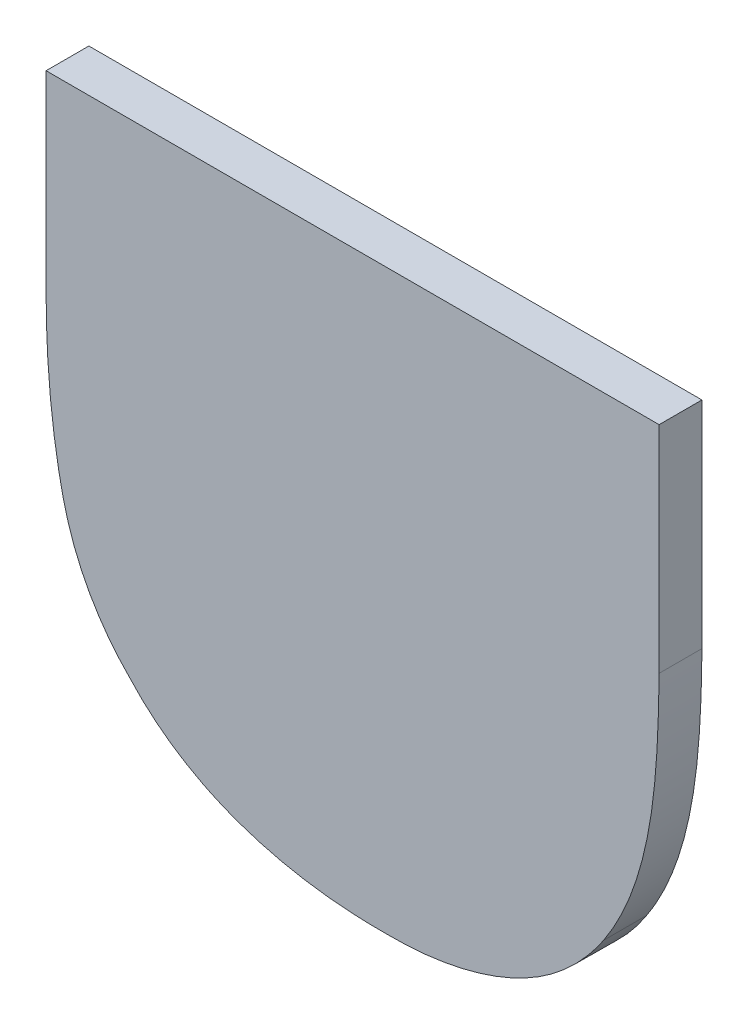
ISO-10303-21;
HEADER;
FILE_DESCRIPTION(('STEP AP214'),'2;1');
FILE_NAME('part.step','',(''),(''),'','','');
FILE_SCHEMA(('AUTOMOTIVE_DESIGN { 1 0 10303 214 1 1 1 1 }'));
ENDSEC;
DATA;
#1=APPLICATION_CONTEXT('core data for automotive mechanical design processes');
#2=APPLICATION_PROTOCOL_DEFINITION('international standard','automotive_design',2000,#1);
#3=PRODUCT_CONTEXT('',#1,'mechanical');
#4=PRODUCT('Part','Part','',(#3));
#5=PRODUCT_RELATED_PRODUCT_CATEGORY('part','',(#4));
#6=PRODUCT_DEFINITION_FORMATION('','',#4);
#7=PRODUCT_DEFINITION_CONTEXT('part definition',#1,'design');
#8=PRODUCT_DEFINITION('design','',#6,#7);
#9=PRODUCT_DEFINITION_SHAPE('','',#8);
#10=(LENGTH_UNIT() NAMED_UNIT(*) SI_UNIT(.MILLI.,.METRE.));
#11=(NAMED_UNIT(*) PLANE_ANGLE_UNIT() SI_UNIT($,.RADIAN.));
#12=(NAMED_UNIT(*) SI_UNIT($,.STERADIAN.) SOLID_ANGLE_UNIT());
#13=UNCERTAINTY_MEASURE_WITH_UNIT(LENGTH_MEASURE(1.E-05),#10,'distance_accuracy_value','');
#14=(GEOMETRIC_REPRESENTATION_CONTEXT(3) GLOBAL_UNCERTAINTY_ASSIGNED_CONTEXT((#13)) GLOBAL_UNIT_ASSIGNED_CONTEXT((#10,
#11,#12)) REPRESENTATION_CONTEXT('',''));
#15=CARTESIAN_POINT('',(0.,0.,0.));
#16=DIRECTION('',(0.,0.,1.));
#17=DIRECTION('',(1.,0.,0.));
#18=AXIS2_PLACEMENT_3D('',#15,#16,#17);
#19=CARTESIAN_POINT('',(0.347917285868027,-0.886536157779015,0.));
#20=DIRECTION('',(1.,0.,0.));
#21=DIRECTION('',(0.,1.,0.));
#22=AXIS2_PLACEMENT_3D('',#19,#20,#21);
#23=PLANE('',#22);
#24=DIRECTION('',(0.,-1.,0.));
#25=VECTOR('',#24,1.);
#26=CARTESIAN_POINT('',(0.347917285868027,-0.876470841363199,-0.001));
#27=LINE('',#26,#25);
#28=CARTESIAN_POINT('',(0.347917285868027,-0.876470841363199,-0.001));
#29=VERTEX_POINT('',#28);
#30=CARTESIAN_POINT('',(0.347917285868027,-0.886536157779015,-0.001));
#31=VERTEX_POINT('',#30);
#32=EDGE_CURVE('E11',#29,#31,#27,.T.);
#33=ORIENTED_EDGE('',*,*,#32,.F.);
#34=DIRECTION('',(0.,0.,1.));
#35=VECTOR('',#34,1.);
#36=CARTESIAN_POINT('',(0.347917285868027,-0.876470841363199,-0.001));
#37=LINE('',#36,#35);
#38=CARTESIAN_POINT('',(0.347917285868027,-0.876470841363199,0.001));
#39=VERTEX_POINT('',#38);
#40=EDGE_CURVE('E154',#29,#39,#37,.T.);
#41=ORIENTED_EDGE('',*,*,#40,.T.);
#42=DIRECTION('',(0.,1.,0.));
#43=VECTOR('',#42,1.);
#44=CARTESIAN_POINT('',(0.347917285868027,-0.886536157779015,0.001));
#45=LINE('',#44,#43);
#46=CARTESIAN_POINT('',(0.347917285868027,-0.886536157779015,0.001));
#47=VERTEX_POINT('',#46);
#48=EDGE_CURVE('E98',#47,#39,#45,.T.);
#49=ORIENTED_EDGE('',*,*,#48,.F.);
#50=DIRECTION('',(0.,0.,1.));
#51=VECTOR('',#50,1.);
#52=CARTESIAN_POINT('',(0.347917285868027,-0.886536157779015,-0.001));
#53=LINE('',#52,#51);
#54=EDGE_CURVE('E155',#31,#47,#53,.T.);
#55=ORIENTED_EDGE('',*,*,#54,.F.);
#56=EDGE_LOOP('',(#33,#41,#49,#55));
#57=FACE_BOUND('',#56,.T.);
#58=ADVANCED_FACE('F17',(#57),#23,.T.);
#59=CARTESIAN_POINT('',(0.345323768754749,-0.898639237640978,-0.0015));
#60=CARTESIAN_POINT('',(0.345323768754749,-0.898639237640978,0.0015));
#61=CARTESIAN_POINT('',(0.346744028126305,-0.896477973379914,-0.0015));
#62=CARTESIAN_POINT('',(0.346744028126305,-0.896477973379914,0.0015));
#63=CARTESIAN_POINT('',(0.347917285868027,-0.890735185486226,-0.0015));
#64=CARTESIAN_POINT('',(0.347917285868027,-0.890735185486226,0.0015));
#65=CARTESIAN_POINT('',(0.347917285868027,-0.886536157779015,-0.0015));
#66=CARTESIAN_POINT('',(0.347917285868027,-0.886536157779015,0.0015));
#67=B_SPLINE_SURFACE_WITH_KNOTS('',2,1,((#59,#60),(#61,#62),(#63,#64),(#65,#66)),.UNSPECIFIED.,
.F.,.F.,.F.,(3,1,3),(2,2),(0.,0.5,1.),(0.,1.),.UNSPECIFIED.);
#68=CARTESIAN_POINT('',(0.347917285868027,-0.886536157779015,-0.001));
#69=CARTESIAN_POINT('',(0.347897046364982,-0.888475739742811,-0.001));
#70=CARTESIAN_POINT('',(0.347837067685021,-0.890524183312478,-0.001));
#71=CARTESIAN_POINT('',(0.34729821677121,-0.893963282759517,-0.001));
#72=CARTESIAN_POINT('',(0.346939214250349,-0.895379773236329,-0.001));
#73=CARTESIAN_POINT('',(0.346077134854573,-0.897375988092695,-0.001));
#74=CARTESIAN_POINT('',(0.34573299174689,-0.898023229237234,-0.001));
#75=CARTESIAN_POINT('',(0.345323769955808,-0.898639235813278,-0.001));
#76=B_SPLINE_CURVE_WITH_KNOTS('',3,(#68,#69,#70,#71,#72,#73,#74,#75),.UNSPECIFIED.,.F.,.F.,(4,2,
2,4),(0.,0.00599493220095094,0.0103394260310423,0.0125364205913056),.UNSPECIFIED.);
#77=CARTESIAN_POINT('',(0.345323768754749,-0.898639237640978,-0.001));
#78=VERTEX_POINT('',#77);
#79=EDGE_CURVE('E24',#31,#78,#76,.T.);
#80=CARTESIAN_POINT('',(0.345323768754749,-0.898639237640978,0.001));
#81=CARTESIAN_POINT('',(0.346080441199102,-0.897495281511019,0.001));
#82=CARTESIAN_POINT('',(0.346612732508816,-0.896265386786534,0.001));
#83=CARTESIAN_POINT('',(0.347422866538483,-0.893508900287757,0.001));
#84=CARTESIAN_POINT('',(0.347648296370756,-0.891965906220623,0.001));
#85=CARTESIAN_POINT('',(0.347871267663927,-0.889116463505151,0.001));
#86=CARTESIAN_POINT('',(0.347899995515492,-0.887812505666125,0.001));
#87=CARTESIAN_POINT('',(0.347917285868027,-0.886536157779015,0.001));
#88=B_SPLINE_CURVE_WITH_KNOTS('',3,(#80,#81,#82,#83,#84,#85,#86,#87),.UNSPECIFIED.,.F.,.F.,(4,2,
2,4),(0.,0.00401420591504729,0.00865238375037323,0.0125336361899949),.UNSPECIFIED.);
#89=CARTESIAN_POINT('',(0.345323768754749,-0.898639237640978,0.001));
#90=VERTEX_POINT('',#89);
#91=EDGE_CURVE('E206',#90,#47,#88,.T.);
#92=DIRECTION('',(0.,0.,1.));
#93=VECTOR('',#92,1.);
#94=CARTESIAN_POINT('',(0.345323768754749,-0.898639237640978,-0.001));
#95=LINE('',#94,#93);
#96=EDGE_CURVE('E109',#78,#90,#95,.T.);
#97=ORIENTED_EDGE('',*,*,#79,.F.);
#98=ORIENTED_EDGE('',*,*,#54,.T.);
#99=ORIENTED_EDGE('',*,*,#91,.F.);
#100=ORIENTED_EDGE('',*,*,#96,.F.);
#101=EDGE_LOOP('',(#97,#98,#99,#100));
#102=FACE_BOUND('',#101,.T.);
#103=ADVANCED_FACE('F139',(#102),#67,.T.);
#104=CARTESIAN_POINT('',(0.335196701931473,-0.90345576942278,-0.0015));
#105=CARTESIAN_POINT('',(0.335196701931473,-0.90345576942278,0.0015));
#106=CARTESIAN_POINT('',(0.33853122393426,-0.90345576942278,-0.0015));
#107=CARTESIAN_POINT('',(0.33853122393426,-0.90345576942278,0.0015));
#108=CARTESIAN_POINT('',(0.343656507753354,-0.901109253939338,-0.0015));
#109=CARTESIAN_POINT('',(0.343656507753354,-0.901109253939338,0.0015));
#110=CARTESIAN_POINT('',(0.345323768754749,-0.898639237640978,-0.0015));
#111=CARTESIAN_POINT('',(0.345323768754749,-0.898639237640978,0.0015));
#112=B_SPLINE_SURFACE_WITH_KNOTS('',2,1,((#104,#105),(#106,#107),(#108,#109),(#110,#111)),
.UNSPECIFIED.,.F.,.F.,.F.,(3,1,3),(2,2),(0.,0.5,1.),(0.,1.),.UNSPECIFIED.);
#113=CARTESIAN_POINT('',(0.345323768754749,-0.898639237640978,-0.001));
#114=CARTESIAN_POINT('',(0.344734853257119,-0.899568366142899,-0.001));
#115=CARTESIAN_POINT('',(0.343982251990601,-0.900373776664964,-0.001));
#116=CARTESIAN_POINT('',(0.342298146571294,-0.901681608063643,-0.001));
#117=CARTESIAN_POINT('',(0.341375697767304,-0.90219554041433,-0.001));
#118=CARTESIAN_POINT('',(0.339291439211212,-0.903002517016533,-0.001));
#119=CARTESIAN_POINT('',(0.338114275327939,-0.903253297250384,-0.001));
#120=CARTESIAN_POINT('',(0.336350580432896,-0.90342912278177,-0.001));
#121=CARTESIAN_POINT('',(0.335771640335706,-0.90345535977683,-0.001));
#122=CARTESIAN_POINT('',(0.335196699439591,-0.90345576942278,-0.001));
#123=B_SPLINE_CURVE_WITH_KNOTS('',3,(#113,#114,#115,#116,#117,#118,#119,#120,#121,#122),
.UNSPECIFIED.,.F.,.F.,(4,2,2,2,4),(0.,0.00325917926200646,0.00637860238294145,
0.00994552343462519,0.0116780444668039),.UNSPECIFIED.);
#124=CARTESIAN_POINT('',(0.335196701931473,-0.90345576942278,-0.001));
#125=VERTEX_POINT('',#124);
#126=EDGE_CURVE('E147',#78,#125,#123,.T.);
#127=CARTESIAN_POINT('',(0.335196701931473,-0.90345576942278,0.001));
#128=CARTESIAN_POINT('',(0.336716202489575,-0.903476443464815,0.001));
#129=CARTESIAN_POINT('',(0.338304646776791,-0.903269722110897,0.001));
#130=CARTESIAN_POINT('',(0.340893616482345,-0.902429352559061,0.001));
#131=CARTESIAN_POINT('',(0.341939610540156,-0.901920705360191,0.001));
#132=CARTESIAN_POINT('',(0.343341255163998,-0.900887766351497,0.001));
#133=CARTESIAN_POINT('',(0.343787173464901,-0.900488336916783,0.001));
#134=CARTESIAN_POINT('',(0.344610967095562,-0.899614244805784,0.001));
#135=CARTESIAN_POINT('',(0.344987885543507,-0.899138674075068,0.001));
#136=CARTESIAN_POINT('',(0.345323768875331,-0.898639237462339,0.001));
#137=B_SPLINE_CURVE_WITH_KNOTS('',3,(#127,#128,#129,#130,#131,#132,#133,#134,#135,#136),
.UNSPECIFIED.,.F.,.F.,(4,2,2,2,4),(0.,0.00464434018493601,0.00808092896431612,
0.00986685997050239,0.0116759399575382),.UNSPECIFIED.);
#138=CARTESIAN_POINT('',(0.335196701931473,-0.90345576942278,0.001));
#139=VERTEX_POINT('',#138);
#140=EDGE_CURVE('E193',#139,#90,#137,.T.);
#141=DIRECTION('',(0.,0.,-1.));
#142=VECTOR('',#141,1.);
#143=CARTESIAN_POINT('',(0.335196701931473,-0.90345576942278,0.001));
#144=LINE('',#143,#142);
#145=EDGE_CURVE('E200',#139,#125,#144,.T.);
#146=ORIENTED_EDGE('',*,*,#126,.F.);
#147=ORIENTED_EDGE('',*,*,#96,.T.);
#148=ORIENTED_EDGE('',*,*,#140,.F.);
#149=ORIENTED_EDGE('',*,*,#145,.T.);
#150=EDGE_LOOP('',(#146,#147,#148,#149));
#151=FACE_BOUND('',#150,.T.);
#152=ADVANCED_FACE('F135',(#151),#112,.T.);
#153=CARTESIAN_POINT('',(0.323217122884428,-0.899133240900648,-0.0015));
#154=CARTESIAN_POINT('',(0.323217122884428,-0.899133240900648,0.0015));
#155=CARTESIAN_POINT('',(0.325316636738034,-0.901356255569174,-0.0015));
#156=CARTESIAN_POINT('',(0.325316636738034,-0.901356255569174,0.0015));
#157=CARTESIAN_POINT('',(0.331244675854099,-0.90345576942278,-0.0015));
#158=CARTESIAN_POINT('',(0.331244675854099,-0.90345576942278,0.0015));
#159=CARTESIAN_POINT('',(0.335196701931473,-0.90345576942278,-0.0015));
#160=CARTESIAN_POINT('',(0.335196701931473,-0.90345576942278,0.0015));
#161=B_SPLINE_SURFACE_WITH_KNOTS('',2,1,((#153,#154),(#155,#156),(#157,#158),(#159,#160)),
.UNSPECIFIED.,.F.,.F.,.F.,(3,1,3),(2,2),(0.,0.5,1.),(0.,1.),.UNSPECIFIED.);
#162=CARTESIAN_POINT('',(0.335196701931473,-0.90345576942278,-0.001));
#163=CARTESIAN_POINT('',(0.334203486748448,-0.903450311446005,-0.001));
#164=CARTESIAN_POINT('',(0.333205007331225,-0.903403812510657,-0.001));
#165=CARTESIAN_POINT('',(0.331210286285869,-0.903175252313575,-0.001));
#166=CARTESIAN_POINT('',(0.330214286370927,-0.902991238037913,-0.001));
#167=CARTESIAN_POINT('',(0.327863731895975,-0.90231507219139,-0.001));
#168=CARTESIAN_POINT('',(0.326531904126368,-0.901726738528531,-0.001));
#169=CARTESIAN_POINT('',(0.324564610621589,-0.900421256179006,-0.001));
#170=CARTESIAN_POINT('',(0.323848710923575,-0.899821592367772,-0.001));
#171=CARTESIAN_POINT('',(0.323217122851809,-0.89913324086611,-0.001));
#172=B_SPLINE_CURVE_WITH_KNOTS('',3,(#162,#163,#164,#165,#166,#167,#168,#169,#170,#171),
.UNSPECIFIED.,.F.,.F.,(4,2,2,2,4),(0.,0.00298647135879083,0.00601618283746282,
0.0103031655704413,0.0130870993535112),.UNSPECIFIED.);
#173=CARTESIAN_POINT('',(0.323217122884428,-0.899133240900648,-0.001));
#174=VERTEX_POINT('',#173);
#175=EDGE_CURVE('E105',#125,#174,#172,.T.);
#176=CARTESIAN_POINT('',(0.323217122884428,-0.899133240900648,0.001));
#177=CARTESIAN_POINT('',(0.32410977556624,-0.900114073477916,0.001));
#178=CARTESIAN_POINT('',(0.325151375142373,-0.900897835863709,0.001));
#179=CARTESIAN_POINT('',(0.327478967343012,-0.902160415157451,0.001));
#180=CARTESIAN_POINT('',(0.328774540324852,-0.902622121637017,0.001));
#181=CARTESIAN_POINT('',(0.331784641557628,-0.903322347279115,0.001));
#182=CARTESIAN_POINT('',(0.333522013588785,-0.903474416834438,0.001));
#183=CARTESIAN_POINT('',(0.335196704801078,-0.90345576942278,0.001));
#184=B_SPLINE_CURVE_WITH_KNOTS('',3,(#176,#177,#178,#179,#180,#181,#182,#183),.UNSPECIFIED.,.F.,
.F.,(4,2,2,4),(0.,0.00388468338967754,0.00796262500969223,0.0130761194440126),.UNSPECIFIED.);
#185=CARTESIAN_POINT('',(0.323217122884428,-0.899133240900648,0.001));
#186=VERTEX_POINT('',#185);
#187=EDGE_CURVE('E161',#186,#139,#184,.T.);
#188=DIRECTION('',(0.,0.,1.));
#189=VECTOR('',#188,1.);
#190=CARTESIAN_POINT('',(0.323217122884428,-0.899133240900648,-0.001));
#191=LINE('',#190,#189);
#192=EDGE_CURVE('E163',#174,#186,#191,.T.);
#193=ORIENTED_EDGE('',*,*,#175,.F.);
#194=ORIENTED_EDGE('',*,*,#145,.F.);
#195=ORIENTED_EDGE('',*,*,#187,.F.);
#196=ORIENTED_EDGE('',*,*,#192,.F.);
#197=EDGE_LOOP('',(#193,#194,#195,#196));
#198=FACE_BOUND('',#197,.T.);
#199=ADVANCED_FACE('F124',(#198),#161,.T.);
#200=CARTESIAN_POINT('',(0.319265096807054,-0.885362900037293,-0.0015));
#201=CARTESIAN_POINT('',(0.319265096807054,-0.885362900037293,0.0015));
#202=CARTESIAN_POINT('',(0.319265096807054,-0.889747178966884,-0.0015));
#203=CARTESIAN_POINT('',(0.319265096807054,-0.889747178966884,0.0015));
#204=CARTESIAN_POINT('',(0.320808856993528,-0.896724975009747,-0.0015));
#205=CARTESIAN_POINT('',(0.320808856993528,-0.896724975009747,0.0015));
#206=CARTESIAN_POINT('',(0.323217122884428,-0.899133240900648,-0.0015));
#207=CARTESIAN_POINT('',(0.323217122884428,-0.899133240900648,0.0015));
#208=B_SPLINE_SURFACE_WITH_KNOTS('',2,1,((#200,#201),(#202,#203),(#204,#205),(#206,#207)),
.UNSPECIFIED.,.F.,.F.,.F.,(3,1,3),(2,2),(0.,0.5,1.),(0.,1.),.UNSPECIFIED.);
#209=CARTESIAN_POINT('',(0.319265096807054,-0.885362893238269,-0.001));
#210=CARTESIAN_POINT('',(0.319265096869153,-0.885467021894999,-0.001));
#211=CARTESIAN_POINT('',(0.319265423335868,-0.885571150653738,-0.001));
#212=CARTESIAN_POINT('',(0.319266739057579,-0.885778643526549,-0.001));
#213=CARTESIAN_POINT('',(0.319267723455102,-0.885882007671557,-0.001));
#214=CARTESIAN_POINT('',(0.319270354946234,-0.886087969949834,-0.001));
#215=CARTESIAN_POINT('',(0.319271997130472,-0.886190568145523,-0.001));
#216=CARTESIAN_POINT('',(0.319275944179671,-0.886394997123516,-0.001));
#217=CARTESIAN_POINT('',(0.319278244083102,-0.88649682800142,-0.001));
#218=CARTESIAN_POINT('',(0.319283506487725,-0.886699721003851,-0.001));
#219=CARTESIAN_POINT('',(0.319286463976096,-0.886800783258163,-0.001));
#220=CARTESIAN_POINT('',(0.319293041438228,-0.887002137709549,-0.001));
#221=CARTESIAN_POINT('',(0.319296656348539,-0.887102430071796,-0.001));
#222=CARTESIAN_POINT('',(0.319304548502557,-0.887302243478066,-0.001));
#223=CARTESIAN_POINT('',(0.319308820633005,-0.887401764723811,-0.001));
#224=CARTESIAN_POINT('',(0.319318027038294,-0.887600034677152,-0.001));
#225=CARTESIAN_POINT('',(0.31932295615095,-0.887698783624204,-0.001));
#226=CARTESIAN_POINT('',(0.31933347629385,-0.88789550780176,-0.001));
#227=CARTESIAN_POINT('',(0.31933906211396,-0.887993483310635,-0.001));
#228=CARTESIAN_POINT('',(0.319350895407274,-0.888188659474819,-0.001));
#229=CARTESIAN_POINT('',(0.319357137623464,-0.888285860448599,-0.001));
#230=CARTESIAN_POINT('',(0.319370283406613,-0.888479486446985,-0.001));
#231=CARTESIAN_POINT('',(0.319377181670844,-0.888575911831346,-0.001));
#232=CARTESIAN_POINT('',(0.319391639022043,-0.888767983101464,-0.001));
#233=CARTESIAN_POINT('',(0.319399192743451,-0.888863629390821,-0.001));
#234=CARTESIAN_POINT('',(0.319414960509223,-0.889054140675362,-0.001));
#235=CARTESIAN_POINT('',(0.319423169138943,-0.889149006118415,-0.001));
#236=CARTESIAN_POINT('',(0.319440246614042,-0.889337959006441,-0.001));
#237=CARTESIAN_POINT('',(0.31944911003533,-0.889432046941362,-0.001));
#238=CARTESIAN_POINT('',(0.319467497068265,-0.889619448042137,-0.001));
#239=CARTESIAN_POINT('',(0.319477015247869,-0.889712761740677,-0.001));
#240=CARTESIAN_POINT('',(0.319496711852085,-0.889898617502759,-0.001));
#241=CARTESIAN_POINT('',(0.319506884838086,-0.889991160142384,-0.001));
#242=CARTESIAN_POINT('',(0.319527891189686,-0.890175476825777,-0.001));
#243=CARTESIAN_POINT('',(0.319538719111595,-0.890267251489662,-0.001));
#244=CARTESIAN_POINT('',(0.319561035548979,-0.890450035165935,-0.001));
#245=CARTESIAN_POINT('',(0.319572518617284,-0.89054104484308,-0.001));
#246=CARTESIAN_POINT('',(0.319596145642294,-0.890722301395151,-0.001));
#247=CARTESIAN_POINT('',(0.319608284150052,-0.89081254898005,-0.001));
#248=CARTESIAN_POINT('',(0.319633222423608,-0.890992284103135,-0.001));
#249=CARTESIAN_POINT('',(0.319646016740545,-0.891081772397039,-0.001));
#250=CARTESIAN_POINT('',(0.319672267098694,-0.891259991595236,-0.001));
#251=CARTESIAN_POINT('',(0.31968571769296,-0.891348723301515,-0.001));
#252=CARTESIAN_POINT('',(0.319713277598729,-0.891525409533311,-0.001));
#253=CARTESIAN_POINT('',(0.319727381277074,-0.891613364937155,-0.001));
#254=CARTESIAN_POINT('',(0.319756245132543,-0.891788486349722,-0.001));
#255=CARTESIAN_POINT('',(0.319770999552879,-0.891875653307004,-0.001));
#256=CARTESIAN_POINT('',(0.319801165958178,-0.892049212310369,-0.001));
#257=CARTESIAN_POINT('',(0.319816572301652,-0.892135605336504,-0.001));
#258=CARTESIAN_POINT('',(0.319848047230528,-0.892307629788306,-0.001));
#259=CARTESIAN_POINT('',(0.319864110268031,-0.892393262229166,-0.001));
#260=CARTESIAN_POINT('',(0.3198968918712,-0.892563780901141,-0.001));
#261=CARTESIAN_POINT('',(0.319913605067519,-0.892648668163041,-0.001));
#262=CARTESIAN_POINT('',(0.319947724280097,-0.8928177019344,-0.001));
#263=CARTESIAN_POINT('',(0.319965124807632,-0.892901849553661,-0.001));
#264=CARTESIAN_POINT('',(0.320000495366494,-0.893069443936206,-0.001));
#265=CARTESIAN_POINT('',(0.320018460868397,-0.893152891653122,-0.001));
#266=CARTESIAN_POINT('',(0.32005543454367,-0.893319001628947,-0.001));
#267=CARTESIAN_POINT('',(0.320074435352695,-0.893401665506581,-0.001));
#268=CARTESIAN_POINT('',(0.320113954967982,-0.893566117968858,-0.001));
#269=CARTESIAN_POINT('',(0.320134464217443,-0.893647908843596,-0.001));
#270=CARTESIAN_POINT('',(0.320176884066416,-0.893810658701024,-0.001));
#271=CARTESIAN_POINT('',(0.320198786584048,-0.89389161979334,-0.001));
#272=CARTESIAN_POINT('',(0.320244024068051,-0.894052678463933,-0.001));
#273=CARTESIAN_POINT('',(0.320267350827224,-0.894132778344636,-0.001));
#274=CARTESIAN_POINT('',(0.32031542352232,-0.894292089922982,-0.001));
#275=CARTESIAN_POINT('',(0.320340161316697,-0.894371304077124,-0.001));
#276=CARTESIAN_POINT('',(0.320391052161927,-0.894528818175064,-0.001));
#277=CARTESIAN_POINT('',(0.320417197113611,-0.894607120734493,-0.001));
#278=CARTESIAN_POINT('',(0.320470893636276,-0.894762787429492,-0.001));
#279=CARTESIAN_POINT('',(0.320498437199509,-0.89484015432655,-0.001));
#280=CARTESIAN_POINT('',(0.320554921332764,-0.894993926456665,-0.001));
#281=CARTESIAN_POINT('',(0.320583854013778,-0.895070334586751,-0.001));
#282=CARTESIAN_POINT('',(0.320643105207462,-0.895222168174441,-0.001));
#283=CARTESIAN_POINT('',(0.320673416000538,-0.895297596643836,-0.001));
#284=CARTESIAN_POINT('',(0.320735430887546,-0.895447499971358,-0.001));
#285=CARTESIAN_POINT('',(0.320767128447299,-0.895521977532113,-0.001));
#286=CARTESIAN_POINT('',(0.320831921243242,-0.895669995179397,-0.001));
#287=CARTESIAN_POINT('',(0.3208650108949,-0.895743537710043,-0.001));
#288=CARTESIAN_POINT('',(0.320932582719603,-0.895889677658179,-0.001));
#289=CARTESIAN_POINT('',(0.320967059788577,-0.895962277435314,-0.001));
#290=CARTESIAN_POINT('',(0.321037400646467,-0.896106524681133,-0.001));
#291=CARTESIAN_POINT('',(0.321073259823076,-0.896178174398678,-0.001));
#292=CARTESIAN_POINT('',(0.321146358453731,-0.89632051477278,-0.001));
#293=CARTESIAN_POINT('',(0.321183593794866,-0.896391207541295,-0.001));
#294=CARTESIAN_POINT('',(0.32125943767511,-0.89653162770697,-0.001));
#295=CARTESIAN_POINT('',(0.321298042604573,-0.896601357053617,-0.001));
#296=CARTESIAN_POINT('',(0.321376616548892,-0.896739842036888,-0.001));
#297=CARTESIAN_POINT('',(0.321416582405885,-0.89680859946512,-0.001));
#298=CARTESIAN_POINT('',(0.321497862928568,-0.896945123876896,-0.001));
#299=CARTESIAN_POINT('',(0.321539174698379,-0.897012892584451,-0.001));
#300=CARTESIAN_POINT('',(0.321623151015572,-0.89714745719174,-0.001));
#301=CARTESIAN_POINT('',(0.321665813625082,-0.897214254300797,-0.001));
#302=CARTESIAN_POINT('',(0.321752500939062,-0.897346898922275,-0.001));
#303=CARTESIAN_POINT('',(0.321796524771761,-0.897412747004423,-0.001));
#304=CARTESIAN_POINT('',(0.321885945597229,-0.897543515691679,-0.001));
#305=CARTESIAN_POINT('',(0.32193134275417,-0.897608436184522,-0.001));
#306=CARTESIAN_POINT('',(0.322023523041198,-0.89773737072047,-0.001));
#307=CARTESIAN_POINT('',(0.322070307339343,-0.897801383928459,-0.001));
#308=CARTESIAN_POINT('',(0.322165276356995,-0.897928523675523,-0.001));
#309=CARTESIAN_POINT('',(0.32221346321141,-0.897991648619822,-0.001));
#310=CARTESIAN_POINT('',(0.322311232322288,-0.898117003342026,-0.001));
#311=CARTESIAN_POINT('',(0.322360817078712,-0.898179231169989,-0.001));
#312=CARTESIAN_POINT('',(0.322461370885636,-0.898302776983214,-0.001));
#313=CARTESIAN_POINT('',(0.322512342641523,-0.898364092766391,-0.001));
#314=CARTESIAN_POINT('',(0.322615669685756,-0.898485814334984,-0.001));
#315=CARTESIAN_POINT('',(0.322668028147778,-0.89854621742606,-0.001));
#316=CARTESIAN_POINT('',(0.322774127807556,-0.898666113543934,-0.001));
#317=CARTESIAN_POINT('',(0.322827872616533,-0.898725603374758,-0.001));
#318=CARTESIAN_POINT('',(0.322936744223506,-0.898843672772954,-0.001));
#319=CARTESIAN_POINT('',(0.322991875038295,-0.898902248635756,-0.001));
#320=CARTESIAN_POINT('',(0.323103517649619,-0.899018490582094,-0.001));
#321=CARTESIAN_POINT('',(0.323160033834318,-0.899076152451455,-0.001));
#322=CARTESIAN_POINT('',(0.323217122884428,-0.899133240900648,-0.001));
#323=B_SPLINE_CURVE_WITH_KNOTS('',3,(#209,#210,#211,#212,#213,#214,#215,#216,#217,#218,#219,
#220,#221,#222,#223,#224,#225,#226,#227,#228,#229,#230,#231,#232,#233,#234,#235,#236,#237,#238,
#239,#240,#241,#242,#243,#244,#245,#246,#247,#248,#249,#250,#251,#252,#253,#254,#255,#256,#257,
#258,#259,#260,#261,#262,#263,#264,#265,#266,#267,#268,#269,#270,#271,#272,#273,#274,#275,#276,
#277,#278,#279,#280,#281,#282,#283,#284,#285,#286,#287,#288,#289,#290,#291,#292,#293,#294,#295,
#296,#297,#298,#299,#300,#301,#302,#303,#304,#305,#306,#307,#308,#309,#310,#311,#312,#313,#314,
#315,#316,#317,#318,#319,#320,#321,#322),.UNSPECIFIED.,.F.,.F.,(4,2,2,2,2,2,2,2,2,2,2,2,2,2,2,2,
2,2,2,2,2,2,2,2,2,2,2,2,2,2,2,2,2,2,2,2,2,2,2,2,2,2,2,2,2,2,2,2,2,2,2,2,2,2,2,2,4),(0.,
0.000312385606882879,0.000622489993715316,0.000930321810749745,0.00123589011793566,
0.00153920438976148,0.00184027452013629,0.00213911082729637,0.0024357240587413,
0.00273012539618181,0.00302232646050445,0.00331233931673531,0.00360016897229846,
0.00388582602497884,0.00416933673445261,0.00445072753211748,0.00473002494970549,
0.00500725563214937,0.00528244635071214,0.00555562401637285,0.00582681569347268,
0.00609604861361389,0.00636328227729022,0.00662849947087861,0.0068917638864817,
0.0071531384311993,0.007412685266325,0.00767046584894305,0.00792654097446918,
0.00818098620214319,0.00843393908647436,0.00868553904269548,0.00893580552245214,
0.00918475089864531,0.00943239120877194,0.00967874580088775,0.00992383696032514,
0.0101676928504391,0.0104105027350032,0.0106524173196663,0.0108935113422975,0.0111338606628548,
0.0113735420244698,0.0116126328083748,0.0118512022666072,0.012089288518027,0.0123270474498574,
0.0125646571447663,0.0128022953574877,0.0130401397013587,0.0132783672600243,0.0135170519056403,
0.0137562412490673,0.0139960356574111,0.0142365347362094,0.014477837200431,0.014720040750996),.UNSPECIFIED.);
#324=CARTESIAN_POINT('',(0.319265096807054,-0.885362900037293,-0.001));
#325=VERTEX_POINT('',#324);
#326=EDGE_CURVE('E203',#174,#325,#323,.F.);
#327=CARTESIAN_POINT('',(0.323217122891534,-0.899133240907754,0.001));
#328=CARTESIAN_POINT('',(0.323150539923692,-0.899066659064548,0.001));
#329=CARTESIAN_POINT('',(0.323084736369378,-0.898999296800906,0.001));
#330=CARTESIAN_POINT('',(0.322955021722857,-0.898863321591416,0.001));
#331=CARTESIAN_POINT('',(0.322891103761994,-0.898794715197229,0.001));
#332=CARTESIAN_POINT('',(0.32276516049931,-0.898656252373647,0.001));
#333=CARTESIAN_POINT('',(0.322703129037146,-0.898586401548971,0.001));
#334=CARTESIAN_POINT('',(0.322580958353914,-0.898445451756782,0.001));
#335=CARTESIAN_POINT('',(0.322520813754231,-0.898374357451821,0.001));
#336=CARTESIAN_POINT('',(0.322402416369487,-0.898230922300709,0.001));
#337=CARTESIAN_POINT('',(0.322344159055371,-0.89815858519349,0.001));
#338=CARTESIAN_POINT('',(0.322229549141373,-0.89801268332352,0.001));
#339=CARTESIAN_POINT('',(0.322173192509841,-0.89793912172802,0.001));
#340=CARTESIAN_POINT('',(0.322062390676247,-0.897790785193358,0.001));
#341=CARTESIAN_POINT('',(0.322007942122949,-0.897716012757601,0.001));
#342=CARTESIAN_POINT('',(0.321900931964527,-0.897565227545721,0.001));
#343=CARTESIAN_POINT('',(0.321848368756113,-0.897489215907473,0.001));
#344=CARTESIAN_POINT('',(0.321745107304927,-0.897335922694509,0.001));
#345=CARTESIAN_POINT('',(0.321694409291282,-0.897258640965445,0.001));
#346=CARTESIAN_POINT('',(0.321594859187999,-0.897102775901935,0.001));
#347=CARTESIAN_POINT('',(0.321546009226195,-0.897024191208474,0.001));
#348=CARTESIAN_POINT('',(0.321450139159393,-0.896865686507063,0.001));
#349=CARTESIAN_POINT('',(0.321403123141108,-0.896785764027412,0.001));
#350=CARTESIAN_POINT('',(0.321310924172411,-0.896624576489581,0.001));
#351=CARTESIAN_POINT('',(0.321265746626499,-0.89654330834027,0.001));
#352=CARTESIAN_POINT('',(0.321177244767436,-0.896379452709709,0.001));
#353=CARTESIAN_POINT('',(0.3211339264502,-0.896296861990299,0.001));
#354=CARTESIAN_POINT('',(0.321049156279588,-0.896130377377937,0.001));
#355=CARTESIAN_POINT('',(0.321007711214384,-0.896046480029111,0.001));
#356=CARTESIAN_POINT('',(0.320926699069208,-0.895877399401631,0.001));
#357=CARTESIAN_POINT('',(0.32088713955597,-0.895792212498176,0.001));
#358=CARTESIAN_POINT('',(0.320809908340248,-0.895620571087787,0.000999999999999999));
#359=CARTESIAN_POINT('',(0.320772244959777,-0.895534112837157,0.000999999999999999));
#360=CARTESIAN_POINT('',(0.320698814122592,-0.895359948146787,0.000999999999999999));
#361=CARTESIAN_POINT('',(0.32066305571057,-0.895272237894665,0.000999999999999999));
#362=CARTESIAN_POINT('',(0.320593435447513,-0.895095574798405,0.000999999999999999));
#363=CARTESIAN_POINT('',(0.320559583673629,-0.895006617984303,0.000999999999999999));
#364=CARTESIAN_POINT('',(0.320493757092517,-0.894827414439124,0.000999999999999999));
#365=CARTESIAN_POINT('',(0.320461794593762,-0.894737163188271,0.000999999999999999));
#366=CARTESIAN_POINT('',(0.320399752742486,-0.894555380944937,0.000999999999999999));
#367=CARTESIAN_POINT('',(0.320369686524275,-0.894463845472038,0.000999999999999999));
#368=CARTESIAN_POINT('',(0.320311441221987,-0.894279514969463,0.001));
#369=CARTESIAN_POINT('',(0.320283275824088,-0.894186715615871,0.001));
#370=CARTESIAN_POINT('',(0.320228849390602,-0.893999875250587,0.001));
#371=CARTESIAN_POINT('',(0.320202602628789,-0.893905830086864,0.001));
#372=CARTESIAN_POINT('',(0.320151973018828,-0.893716529740443,0.001));
#373=CARTESIAN_POINT('',(0.320127604574024,-0.893621270699254,0.001));
#374=CARTESIAN_POINT('',(0.320080900924116,-0.893429527557996,0.001));
#375=CARTESIAN_POINT('',(0.320058581692772,-0.893333039580195,0.001));
#376=CARTESIAN_POINT('',(0.32001534688799,-0.893139005482559,0.001));
#377=CARTESIAN_POINT('',(0.319994442918514,-0.893041456815023,0.001));
#378=CARTESIAN_POINT('',(0.319953404471976,-0.892845436998767,0.001));
#379=CARTESIAN_POINT('',(0.319933276915444,-0.892746964405367,0.001));
#380=CARTESIAN_POINT('',(0.319893955817514,-0.892549041459155,0.001));
#381=CARTESIAN_POINT('',(0.31987477069467,-0.892449589430509,0.001));
#382=CARTESIAN_POINT('',(0.319837283391762,-0.892249703354818,0.001));
#383=CARTESIAN_POINT('',(0.319818989415068,-0.892149267771981,0.001));
#384=CARTESIAN_POINT('',(0.319783292780742,-0.891947396938716,0.001));
#385=CARTESIAN_POINT('',(0.319765898569574,-0.891845960194609,0.001));
#386=CARTESIAN_POINT('',(0.319731994463446,-0.891642072171345,0.001));
#387=CARTESIAN_POINT('',(0.319715493125368,-0.891539619470259,0.001));
#388=CARTESIAN_POINT('',(0.319683372665632,-0.89133368306454,0.001));
#389=CARTESIAN_POINT('',(0.319667762243304,-0.891230198003643,0.001));
#390=CARTESIAN_POINT('',(0.319637420918243,-0.891022179997635,0.001));
#391=CARTESIAN_POINT('',(0.319622698844005,-0.890917645765528,0.001));
#392=CARTESIAN_POINT('',(0.319594132412668,-0.890707511801942,0.001));
#393=CARTESIAN_POINT('',(0.319580297012939,-0.89060191085344,0.001));
#394=CARTESIAN_POINT('',(0.319553502617864,-0.890389625194651,0.001));
#395=CARTESIAN_POINT('',(0.319540552705258,-0.890282939338639,0.001));
#396=CARTESIAN_POINT('',(0.319515529541294,-0.890068473242989,0.001));
#397=CARTESIAN_POINT('',(0.319503465417929,-0.889960691939,0.001));
#398=CARTESIAN_POINT('',(0.319480219442324,-0.889744071097172,0.001));
#399=CARTESIAN_POINT('',(0.319469046326059,-0.889635230622498,0.001));
#400=CARTESIAN_POINT('',(0.319447583794571,-0.889416499000121,0.001));
#401=CARTESIAN_POINT('',(0.319437302987646,-0.889306607008365,0.001));
#402=CARTESIAN_POINT('',(0.31941762560477,-0.889085773103184,0.001));
#403=CARTESIAN_POINT('',(0.319408237568623,-0.888974830429422,0.001));
#404=CARTESIAN_POINT('',(0.319390346220481,-0.888751895960676,0.001));
#405=CARTESIAN_POINT('',(0.319381851376527,-0.888639903486684,0.001));
#406=CARTESIAN_POINT('',(0.319365746868749,-0.888414870267118,0.001));
#407=CARTESIAN_POINT('',(0.319358145598207,-0.888301828921447,0.001));
#408=CARTESIAN_POINT('',(0.319343828655771,-0.888074698857399,0.001));
#409=CARTESIAN_POINT('',(0.319337121299666,-0.887960609615398,0.001));
#410=CARTESIAN_POINT('',(0.31932459256697,-0.887731384706774,0.001));
#411=CARTESIAN_POINT('',(0.319318779426195,-0.887616248590546,0.001));
#412=CARTESIAN_POINT('',(0.319308039466784,-0.887384930931013,0.001));
#413=CARTESIAN_POINT('',(0.319303120801745,-0.887268749009667,0.001));
#414=CARTESIAN_POINT('',(0.319294170099234,-0.887035340786047,0.001));
#415=CARTESIAN_POINT('',(0.319290146131135,-0.886918114174837,0.001));
#416=CARTESIAN_POINT('',(0.319282985085635,-0.886682617669511,0.001));
#417=CARTESIAN_POINT('',(0.319279855991552,-0.886564347533144,0.001));
#418=CARTESIAN_POINT('',(0.319274484933109,-0.886326765115049,0.001));
#419=CARTESIAN_POINT('',(0.319272250864545,-0.886207452655249,0.001));
#420=CARTESIAN_POINT('',(0.319268670002272,-0.885967786813989,0.001));
#421=CARTESIAN_POINT('',(0.319267331014963,-0.885847433316554,0.001));
#422=CARTESIAN_POINT('',(0.319265540629295,-0.885605686533516,0.001));
#423=CARTESIAN_POINT('',(0.319265096948518,-0.885484293190463,0.001));
#424=CARTESIAN_POINT('',(0.319265096807054,-0.885362900037293,0.001));
#425=B_SPLINE_CURVE_WITH_KNOTS('',3,(#327,#328,#329,#330,#331,#332,#333,#334,#335,#336,#337,
#338,#339,#340,#341,#342,#343,#344,#345,#346,#347,#348,#349,#350,#351,#352,#353,#354,#355,#356,
#357,#358,#359,#360,#361,#362,#363,#364,#365,#366,#367,#368,#369,#370,#371,#372,#373,#374,#375,
#376,#377,#378,#379,#380,#381,#382,#383,#384,#385,#386,#387,#388,#389,#390,#391,#392,#393,#394,
#395,#396,#397,#398,#399,#400,#401,#402,#403,#404,#405,#406,#407,#408,#409,#410,#411,#412,#413,
#414,#415,#416,#417,#418,#419,#420,#421,#422,#423,#424),.UNSPECIFIED.,.F.,.F.,(4,2,2,2,2,2,2,2,
2,2,2,2,2,2,2,2,2,2,2,2,2,2,2,2,2,2,2,2,2,2,2,2,2,2,2,2,2,2,2,2,2,2,2,2,2,2,2,2,4),(0.,
0.000282479791888585,0.000563756019756604,0.000843985071681303,0.00112332513219416,
0.0014019359152289,0.00167991286837049,0.00195737426286853,0.00223459382381272,
0.00251184732657945,0.00278941090119002,0.00306756125668984,0.00334647759002608,
0.00362623456029435,0.00390693511861714,0.00418868079393412,0.00447157104773852,
0.0047557026477861,0.00504121706004115,0.00532842302722379,0.00561743863051497,
0.0059083517876457,0.00620124591926989,0.00649619947618269,0.00679328550156297,
0.00709256905423787,0.00739408990399221,0.00769794052564745,0.0080041994486346,
0.00831294590324276,0.00862425989305504,0.00893822226534853,0.0092549147795718,
0.00957442017400204,0.00989682223069063,0.0102221807332062,0.0105504136052726,
0.0108815247403805,0.011215537969699,0.0115524763405882,0.0118923621298053,0.0122352168566621,
0.0125810612961104,0.0129299154917331,0.0132817987686165,0.013636729746091,0.0139947263503178,
0.0143558058267122,0.0147199847521865),.UNSPECIFIED.);
#426=CARTESIAN_POINT('',(0.319265096807054,-0.885362900037293,0.001));
#427=VERTEX_POINT('',#426);
#428=EDGE_CURVE('E83',#427,#186,#425,.F.);
#429=DIRECTION('',(0.,0.,1.));
#430=VECTOR('',#429,1.);
#431=CARTESIAN_POINT('',(0.319265096807054,-0.885362900037293,-0.001));
#432=LINE('',#431,#430);
#433=EDGE_CURVE('E89',#325,#427,#432,.T.);
#434=ORIENTED_EDGE('',*,*,#326,.F.);
#435=ORIENTED_EDGE('',*,*,#192,.T.);
#436=ORIENTED_EDGE('',*,*,#428,.F.);
#437=ORIENTED_EDGE('',*,*,#433,.F.);
#438=EDGE_LOOP('',(#434,#435,#436,#437));
#439=FACE_BOUND('',#438,.T.);
#440=ADVANCED_FACE('F181',(#439),#208,.T.);
#441=CARTESIAN_POINT('',(0.319265096807054,-0.876470841363199,0.));
#442=DIRECTION('',(-1.,0.,0.));
#443=DIRECTION('',(0.,-1.,0.));
#444=AXIS2_PLACEMENT_3D('',#441,#442,#443);
#445=PLANE('',#444);
#446=DIRECTION('',(0.,1.,0.));
#447=VECTOR('',#446,1.);
#448=CARTESIAN_POINT('',(0.319265096807053,-0.885362900037293,-0.001));
#449=LINE('',#448,#447);
#450=CARTESIAN_POINT('',(0.319265096807054,-0.876470841363199,-0.001));
#451=VERTEX_POINT('',#450);
#452=EDGE_CURVE('E102',#325,#451,#449,.T.);
#453=ORIENTED_EDGE('',*,*,#452,.F.);
#454=ORIENTED_EDGE('',*,*,#433,.T.);
#455=DIRECTION('',(0.,-1.,0.));
#456=VECTOR('',#455,1.);
#457=CARTESIAN_POINT('',(0.319265096807054,-0.876470841363198,0.001));
#458=LINE('',#457,#456);
#459=CARTESIAN_POINT('',(0.319265096807054,-0.876470841363199,0.001));
#460=VERTEX_POINT('',#459);
#461=EDGE_CURVE('E84',#460,#427,#458,.T.);
#462=ORIENTED_EDGE('',*,*,#461,.F.);
#463=DIRECTION('',(0.,0.,1.));
#464=VECTOR('',#463,1.);
#465=CARTESIAN_POINT('',(0.319265096807054,-0.876470841363199,-0.001));
#466=LINE('',#465,#464);
#467=EDGE_CURVE('E73',#451,#460,#466,.T.);
#468=ORIENTED_EDGE('',*,*,#467,.F.);
#469=EDGE_LOOP('',(#453,#454,#462,#468));
#470=FACE_BOUND('',#469,.T.);
#471=ADVANCED_FACE('F87',(#470),#445,.T.);
#472=CARTESIAN_POINT('',(0.347917285868027,-0.876470841363199,0.));
#473=DIRECTION('',(0.,1.,0.));
#474=DIRECTION('',(-1.,0.,0.));
#475=AXIS2_PLACEMENT_3D('',#472,#473,#474);
#476=PLANE('',#475);
#477=DIRECTION('',(1.,0.,0.));
#478=VECTOR('',#477,1.);
#479=CARTESIAN_POINT('',(0.319265096807054,-0.876470841363199,-0.001));
#480=LINE('',#479,#478);
#481=EDGE_CURVE('E80',#451,#29,#480,.T.);
#482=ORIENTED_EDGE('',*,*,#481,.F.);
#483=ORIENTED_EDGE('',*,*,#467,.T.);
#484=DIRECTION('',(-1.,0.,0.));
#485=VECTOR('',#484,1.);
#486=CARTESIAN_POINT('',(0.347917285868027,-0.876470841363199,0.001));
#487=LINE('',#486,#485);
#488=EDGE_CURVE('E77',#39,#460,#487,.T.);
#489=ORIENTED_EDGE('',*,*,#488,.F.);
#490=ORIENTED_EDGE('',*,*,#40,.F.);
#491=EDGE_LOOP('',(#482,#483,#489,#490));
#492=FACE_BOUND('',#491,.T.);
#493=ADVANCED_FACE('F75',(#492),#476,.T.);
#494=CARTESIAN_POINT('',(0.330018694056405,-1.00582244370571,-0.001));
#495=DIRECTION('',(0.,0.,1.));
#496=DIRECTION('',(1.,0.,0.));
#497=AXIS2_PLACEMENT_3D('',#494,#495,#496);
#498=PLANE('',#497);
#499=ORIENTED_EDGE('',*,*,#175,.T.);
#500=ORIENTED_EDGE('',*,*,#326,.T.);
#501=ORIENTED_EDGE('',*,*,#452,.T.);
#502=ORIENTED_EDGE('',*,*,#481,.T.);
#503=ORIENTED_EDGE('',*,*,#32,.T.);
#504=ORIENTED_EDGE('',*,*,#79,.T.);
#505=ORIENTED_EDGE('',*,*,#126,.T.);
#506=EDGE_LOOP('',(#499,#500,#501,#502,#503,#504,#505));
#507=FACE_BOUND('',#506,.T.);
#508=ADVANCED_FACE('F130',(#507),#498,.F.);
#509=CARTESIAN_POINT('',(0.330018694056405,-1.00582244370571,0.001));
#510=DIRECTION('',(0.,0.,1.));
#511=DIRECTION('',(1.,0.,0.));
#512=AXIS2_PLACEMENT_3D('',#509,#510,#511);
#513=PLANE('',#512);
#514=ORIENTED_EDGE('',*,*,#187,.T.);
#515=ORIENTED_EDGE('',*,*,#140,.T.);
#516=ORIENTED_EDGE('',*,*,#91,.T.);
#517=ORIENTED_EDGE('',*,*,#48,.T.);
#518=ORIENTED_EDGE('',*,*,#488,.T.);
#519=ORIENTED_EDGE('',*,*,#461,.T.);
#520=ORIENTED_EDGE('',*,*,#428,.T.);
#521=EDGE_LOOP('',(#514,#515,#516,#517,#518,#519,#520));
#522=FACE_BOUND('',#521,.T.);
#523=ADVANCED_FACE('F95',(#522),#513,.T.);
#524=CLOSED_SHELL('',(#58,#103,#152,#199,#440,#471,#493,#508,#523));
#525=MANIFOLD_SOLID_BREP('B1',#524);
#526=ADVANCED_BREP_SHAPE_REPRESENTATION('',(#18,#525),#14);
#527=SHAPE_DEFINITION_REPRESENTATION(#9,#526);
ENDSEC;
END-ISO-10303-21;
